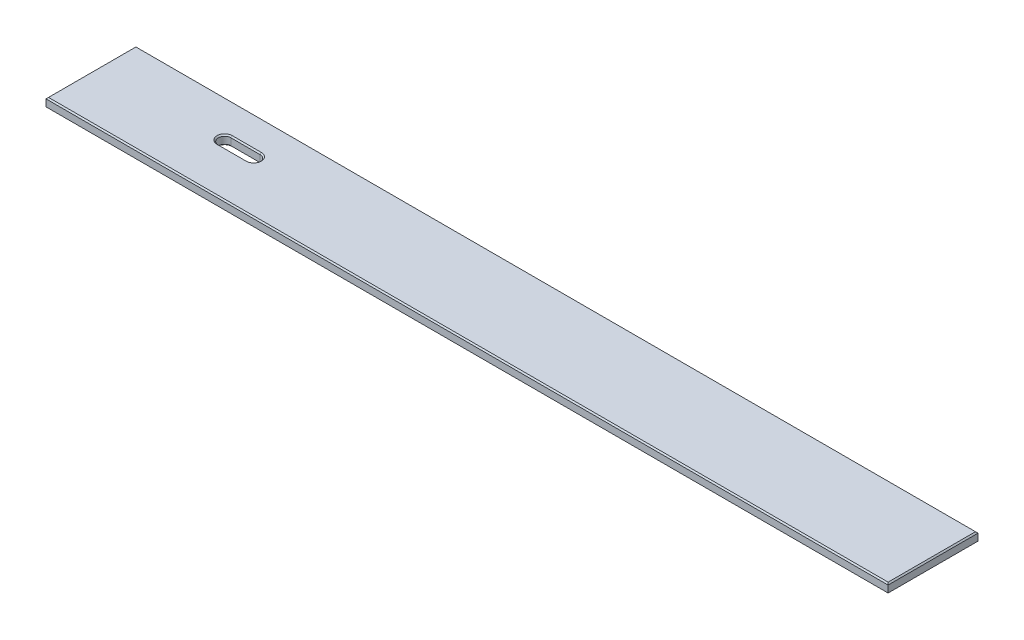
ISO-10303-21;
HEADER;
FILE_DESCRIPTION(('STEP AP214'),'2;1');
FILE_NAME('part.step','',(''),(''),'','','');
FILE_SCHEMA(('AUTOMOTIVE_DESIGN { 1 0 10303 214 1 1 1 1 }'));
ENDSEC;
DATA;
#1=APPLICATION_CONTEXT('core data for automotive mechanical design processes');
#2=APPLICATION_PROTOCOL_DEFINITION('international standard','automotive_design',2000,#1);
#3=PRODUCT_CONTEXT('',#1,'mechanical');
#4=PRODUCT('Part','Part','',(#3));
#5=PRODUCT_RELATED_PRODUCT_CATEGORY('part','',(#4));
#6=PRODUCT_DEFINITION_FORMATION('','',#4);
#7=PRODUCT_DEFINITION_CONTEXT('part definition',#1,'design');
#8=PRODUCT_DEFINITION('design','',#6,#7);
#9=PRODUCT_DEFINITION_SHAPE('','',#8);
#10=(LENGTH_UNIT() NAMED_UNIT(*) SI_UNIT(.MILLI.,.METRE.));
#11=(NAMED_UNIT(*) PLANE_ANGLE_UNIT() SI_UNIT($,.RADIAN.));
#12=(NAMED_UNIT(*) SI_UNIT($,.STERADIAN.) SOLID_ANGLE_UNIT());
#13=UNCERTAINTY_MEASURE_WITH_UNIT(LENGTH_MEASURE(1.E-05),#10,'distance_accuracy_value','');
#14=(GEOMETRIC_REPRESENTATION_CONTEXT(3) GLOBAL_UNCERTAINTY_ASSIGNED_CONTEXT((#13)) GLOBAL_UNIT_ASSIGNED_CONTEXT((#10,
#11,#12)) REPRESENTATION_CONTEXT('',''));
#15=CARTESIAN_POINT('',(0.,0.,0.));
#16=DIRECTION('',(0.,0.,1.));
#17=DIRECTION('',(1.,0.,0.));
#18=AXIS2_PLACEMENT_3D('',#15,#16,#17);
#19=CARTESIAN_POINT('',(0.,19.05,0.));
#20=DIRECTION('',(0.,-1.,0.));
#21=DIRECTION('',(0.,0.,-1.));
#22=AXIS2_PLACEMENT_3D('',#19,#20,#21);
#23=PLANE('',#22);
#24=CARTESIAN_POINT('',(254.,19.05,-105.55605));
#25=DIRECTION('',(0.,-1.,0.));
#26=DIRECTION('',(0.,0.,-1.));
#27=AXIS2_PLACEMENT_3D('',#24,#25,#26);
#28=CIRCLE('',#27,15.2400000000006);
#29=CARTESIAN_POINT('',(254.,19.05,-90.3160499999994));
#30=VERTEX_POINT('',#29);
#31=CARTESIAN_POINT('',(254.,19.05,-120.796050000001));
#32=VERTEX_POINT('',#31);
#33=EDGE_CURVE('E217',#30,#32,#28,.T.);
#34=ORIENTED_EDGE('',*,*,#33,.T.);
#35=DIRECTION('',(1.,0.,0.));
#36=VECTOR('',#35,1.);
#37=CARTESIAN_POINT('',(312.7502,19.05,-120.796050000001));
#38=LINE('',#37,#36);
#39=CARTESIAN_POINT('',(312.7502,19.05,-120.796050000001));
#40=VERTEX_POINT('',#39);
#41=EDGE_CURVE('E219',#32,#40,#38,.T.);
#42=ORIENTED_EDGE('',*,*,#41,.T.);
#43=CARTESIAN_POINT('',(312.7502,19.05,-105.55605));
#44=DIRECTION('',(0.,-1.,0.));
#45=DIRECTION('',(0.,0.,-1.));
#46=AXIS2_PLACEMENT_3D('',#43,#44,#45);
#47=CIRCLE('',#46,15.2400000000006);
#48=CARTESIAN_POINT('',(312.7502,19.05,-90.3160499999994));
#49=VERTEX_POINT('',#48);
#50=EDGE_CURVE('E188',#40,#49,#47,.T.);
#51=ORIENTED_EDGE('',*,*,#50,.T.);
#52=DIRECTION('',(-1.,0.,0.));
#53=VECTOR('',#52,1.);
#54=CARTESIAN_POINT('',(254.,19.05,-90.3160499999994));
#55=LINE('',#54,#53);
#56=EDGE_CURVE('E215',#49,#30,#55,.T.);
#57=ORIENTED_EDGE('',*,*,#56,.T.);
#58=EDGE_LOOP('',(#34,#42,#51,#57));
#59=FACE_BOUND('',#58,.T.);
#60=DIRECTION('',(0.,0.,-1.));
#61=VECTOR('',#60,1.);
#62=CARTESIAN_POINT('',(1692.91,19.05,0.));
#63=LINE('',#62,#61);
#64=CARTESIAN_POINT('',(1692.91,19.05,-2.53999999999999));
#65=VERTEX_POINT('',#64);
#66=CARTESIAN_POINT('',(1692.91,19.05,-178.435));
#67=VERTEX_POINT('',#66);
#68=EDGE_CURVE('E209',#65,#67,#63,.T.);
#69=ORIENTED_EDGE('',*,*,#68,.T.);
#70=DIRECTION('',(-1.,0.,0.));
#71=VECTOR('',#70,1.);
#72=CARTESIAN_POINT('',(0.,19.05,-178.435));
#73=LINE('',#72,#71);
#74=CARTESIAN_POINT('',(2.53999999999999,19.05,-178.435));
#75=VERTEX_POINT('',#74);
#76=EDGE_CURVE('E211',#67,#75,#73,.T.);
#77=ORIENTED_EDGE('',*,*,#76,.T.);
#78=DIRECTION('',(0.,0.,1.));
#79=VECTOR('',#78,1.);
#80=CARTESIAN_POINT('',(2.53999999999999,19.05,0.));
#81=LINE('',#80,#79);
#82=CARTESIAN_POINT('',(2.53999999999999,19.05,-2.53999999999999));
#83=VERTEX_POINT('',#82);
#84=EDGE_CURVE('E198',#75,#83,#81,.T.);
#85=ORIENTED_EDGE('',*,*,#84,.T.);
#86=DIRECTION('',(1.,0.,0.));
#87=VECTOR('',#86,1.);
#88=CARTESIAN_POINT('',(0.,19.05,-2.53999999999999));
#89=LINE('',#88,#87);
#90=EDGE_CURVE('E201',#83,#65,#89,.T.);
#91=ORIENTED_EDGE('',*,*,#90,.T.);
#92=EDGE_LOOP('',(#69,#77,#85,#91));
#93=FACE_BOUND('',#92,.T.);
#94=ADVANCED_FACE('F41',(#59,#93),#23,.F.);
#95=CARTESIAN_POINT('',(0.,0.,0.));
#96=DIRECTION('',(0.,-1.,0.));
#97=DIRECTION('',(0.,0.,-1.));
#98=AXIS2_PLACEMENT_3D('',#95,#96,#97);
#99=PLANE('',#98);
#100=DIRECTION('',(-1.,0.,0.));
#101=VECTOR('',#100,1.);
#102=CARTESIAN_POINT('',(0.,0.,-120.79605));
#103=LINE('',#102,#101);
#104=CARTESIAN_POINT('',(312.7502,0.,-120.79605));
#105=VERTEX_POINT('',#104);
#106=CARTESIAN_POINT('',(254.,0.,-120.79605));
#107=VERTEX_POINT('',#106);
#108=EDGE_CURVE('E261',#105,#107,#103,.T.);
#109=ORIENTED_EDGE('',*,*,#108,.T.);
#110=CARTESIAN_POINT('',(254.,0.,-105.55605));
#111=DIRECTION('',(0.,-1.,0.));
#112=DIRECTION('',(0.,0.,-1.));
#113=AXIS2_PLACEMENT_3D('',#110,#111,#112);
#114=CIRCLE('',#113,15.24);
#115=CARTESIAN_POINT('',(254.,0.,-90.31605));
#116=VERTEX_POINT('',#115);
#117=EDGE_CURVE('E263',#107,#116,#114,.F.);
#118=ORIENTED_EDGE('',*,*,#117,.T.);
#119=DIRECTION('',(1.,0.,0.));
#120=VECTOR('',#119,1.);
#121=CARTESIAN_POINT('',(0.,0.,-90.31605));
#122=LINE('',#121,#120);
#123=CARTESIAN_POINT('',(312.7502,0.,-90.31605));
#124=VERTEX_POINT('',#123);
#125=EDGE_CURVE('E257',#116,#124,#122,.T.);
#126=ORIENTED_EDGE('',*,*,#125,.T.);
#127=CARTESIAN_POINT('',(312.7502,0.,-105.55605));
#128=DIRECTION('',(0.,-1.,0.));
#129=DIRECTION('',(0.,0.,-1.));
#130=AXIS2_PLACEMENT_3D('',#127,#128,#129);
#131=CIRCLE('',#130,15.24);
#132=EDGE_CURVE('E259',#124,#105,#131,.F.);
#133=ORIENTED_EDGE('',*,*,#132,.T.);
#134=EDGE_LOOP('',(#109,#118,#126,#133));
#135=FACE_BOUND('',#134,.T.);
#136=DIRECTION('',(0.,0.,1.));
#137=VECTOR('',#136,1.);
#138=CARTESIAN_POINT('',(1692.91,0.,0.));
#139=LINE('',#138,#137);
#140=CARTESIAN_POINT('',(1692.91,0.,-178.435));
#141=VERTEX_POINT('',#140);
#142=CARTESIAN_POINT('',(1692.91,0.,-2.53999999999999));
#143=VERTEX_POINT('',#142);
#144=EDGE_CURVE('E252',#141,#143,#139,.T.);
#145=ORIENTED_EDGE('',*,*,#144,.T.);
#146=DIRECTION('',(-1.,0.,0.));
#147=VECTOR('',#146,1.);
#148=CARTESIAN_POINT('',(0.,0.,-2.53999999999999));
#149=LINE('',#148,#147);
#150=CARTESIAN_POINT('',(2.53999999999999,0.,-2.53999999999999));
#151=VERTEX_POINT('',#150);
#152=EDGE_CURVE('E254',#143,#151,#149,.T.);
#153=ORIENTED_EDGE('',*,*,#152,.T.);
#154=DIRECTION('',(0.,0.,-1.));
#155=VECTOR('',#154,1.);
#156=CARTESIAN_POINT('',(2.53999999999999,0.,-180.975));
#157=LINE('',#156,#155);
#158=CARTESIAN_POINT('',(2.53999999999999,0.,-178.435));
#159=VERTEX_POINT('',#158);
#160=EDGE_CURVE('E232',#151,#159,#157,.T.);
#161=ORIENTED_EDGE('',*,*,#160,.T.);
#162=DIRECTION('',(1.,0.,0.));
#163=VECTOR('',#162,1.);
#164=CARTESIAN_POINT('',(1695.45,0.,-178.435));
#165=LINE('',#164,#163);
#166=EDGE_CURVE('E250',#159,#141,#165,.T.);
#167=ORIENTED_EDGE('',*,*,#166,.T.);
#168=EDGE_LOOP('',(#145,#153,#161,#167));
#169=FACE_BOUND('',#168,.T.);
#170=ADVANCED_FACE('F306',(#135,#169),#99,.T.);
#171=CARTESIAN_POINT('',(0.,19.05,0.));
#172=DIRECTION('',(1.,0.,0.));
#173=DIRECTION('',(0.,0.,-1.));
#174=AXIS2_PLACEMENT_3D('',#171,#172,#173);
#175=PLANE('',#174);
#176=DIRECTION('',(0.,-1.,0.));
#177=VECTOR('',#176,1.);
#178=CARTESIAN_POINT('',(0.,19.05,-180.975));
#179=LINE('',#178,#177);
#180=CARTESIAN_POINT('',(0.,16.51,-180.975));
#181=VERTEX_POINT('',#180);
#182=CARTESIAN_POINT('',(0.,2.53999999999999,-180.975));
#183=VERTEX_POINT('',#182);
#184=EDGE_CURVE('E182',#181,#183,#179,.T.);
#185=ORIENTED_EDGE('',*,*,#184,.T.);
#186=DIRECTION('',(0.,0.,1.));
#187=VECTOR('',#186,1.);
#188=CARTESIAN_POINT('',(0.,2.53999999999999,0.));
#189=LINE('',#188,#187);
#190=CARTESIAN_POINT('',(0.,2.53999999999999,0.));
#191=VERTEX_POINT('',#190);
#192=EDGE_CURVE('E11',#183,#191,#189,.T.);
#193=ORIENTED_EDGE('',*,*,#192,.T.);
#194=DIRECTION('',(0.,-1.,0.));
#195=VECTOR('',#194,1.);
#196=CARTESIAN_POINT('',(0.,19.05,0.));
#197=LINE('',#196,#195);
#198=CARTESIAN_POINT('',(0.,16.51,0.));
#199=VERTEX_POINT('',#198);
#200=EDGE_CURVE('E199',#199,#191,#197,.T.);
#201=ORIENTED_EDGE('',*,*,#200,.F.);
#202=DIRECTION('',(0.,0.,-1.));
#203=VECTOR('',#202,1.);
#204=CARTESIAN_POINT('',(0.,16.51,0.));
#205=LINE('',#204,#203);
#206=EDGE_CURVE('E230',#199,#181,#205,.T.);
#207=ORIENTED_EDGE('',*,*,#206,.T.);
#208=EDGE_LOOP('',(#185,#193,#201,#207));
#209=FACE_BOUND('',#208,.T.);
#210=ADVANCED_FACE('F379',(#209),#175,.F.);
#211=CARTESIAN_POINT('',(0.,19.05,0.));
#212=DIRECTION('',(0.,0.,-1.));
#213=DIRECTION('',(-1.,0.,0.));
#214=AXIS2_PLACEMENT_3D('',#211,#212,#213);
#215=PLANE('',#214);
#216=ORIENTED_EDGE('',*,*,#200,.T.);
#217=DIRECTION('',(1.,0.,0.));
#218=VECTOR('',#217,1.);
#219=CARTESIAN_POINT('',(1695.45,2.53999999999999,0.));
#220=LINE('',#219,#218);
#221=CARTESIAN_POINT('',(1695.45,2.53999999999999,0.));
#222=VERTEX_POINT('',#221);
#223=EDGE_CURVE('E274',#191,#222,#220,.T.);
#224=ORIENTED_EDGE('',*,*,#223,.T.);
#225=DIRECTION('',(0.,-1.,0.));
#226=VECTOR('',#225,1.);
#227=CARTESIAN_POINT('',(1695.45,19.05,0.));
#228=LINE('',#227,#226);
#229=CARTESIAN_POINT('',(1695.45,16.51,0.));
#230=VERTEX_POINT('',#229);
#231=EDGE_CURVE('E204',#230,#222,#228,.T.);
#232=ORIENTED_EDGE('',*,*,#231,.F.);
#233=DIRECTION('',(-1.,0.,0.));
#234=VECTOR('',#233,1.);
#235=CARTESIAN_POINT('',(0.,16.51,0.));
#236=LINE('',#235,#234);
#237=EDGE_CURVE('E228',#230,#199,#236,.T.);
#238=ORIENTED_EDGE('',*,*,#237,.T.);
#239=EDGE_LOOP('',(#216,#224,#232,#238));
#240=FACE_BOUND('',#239,.T.);
#241=ADVANCED_FACE('F315',(#240),#215,.F.);
#242=CARTESIAN_POINT('',(1695.45,19.05,0.));
#243=DIRECTION('',(-1.,0.,0.));
#244=DIRECTION('',(0.,0.,1.));
#245=AXIS2_PLACEMENT_3D('',#242,#243,#244);
#246=PLANE('',#245);
#247=ORIENTED_EDGE('',*,*,#231,.T.);
#248=DIRECTION('',(0.,0.,-1.));
#249=VECTOR('',#248,1.);
#250=CARTESIAN_POINT('',(1695.45,2.53999999999999,-180.975));
#251=LINE('',#250,#249);
#252=CARTESIAN_POINT('',(1695.45,2.53999999999999,-180.975));
#253=VERTEX_POINT('',#252);
#254=EDGE_CURVE('E66',#222,#253,#251,.T.);
#255=ORIENTED_EDGE('',*,*,#254,.T.);
#256=DIRECTION('',(0.,-1.,0.));
#257=VECTOR('',#256,1.);
#258=CARTESIAN_POINT('',(1695.45,19.05,-180.975));
#259=LINE('',#258,#257);
#260=CARTESIAN_POINT('',(1695.45,16.51,-180.975));
#261=VERTEX_POINT('',#260);
#262=EDGE_CURVE('E320',#261,#253,#259,.T.);
#263=ORIENTED_EDGE('',*,*,#262,.F.);
#264=DIRECTION('',(0.,0.,1.));
#265=VECTOR('',#264,1.);
#266=CARTESIAN_POINT('',(1695.45,16.51,0.));
#267=LINE('',#266,#265);
#268=EDGE_CURVE('E226',#261,#230,#267,.T.);
#269=ORIENTED_EDGE('',*,*,#268,.T.);
#270=EDGE_LOOP('',(#247,#255,#263,#269));
#271=FACE_BOUND('',#270,.T.);
#272=ADVANCED_FACE('F318',(#271),#246,.F.);
#273=CARTESIAN_POINT('',(0.,19.05,-180.975));
#274=DIRECTION('',(0.,0.,1.));
#275=DIRECTION('',(1.,0.,0.));
#276=AXIS2_PLACEMENT_3D('',#273,#274,#275);
#277=PLANE('',#276);
#278=ORIENTED_EDGE('',*,*,#262,.T.);
#279=DIRECTION('',(-1.,0.,0.));
#280=VECTOR('',#279,1.);
#281=CARTESIAN_POINT('',(0.,2.53999999999999,-180.975));
#282=LINE('',#281,#280);
#283=EDGE_CURVE('E51',#253,#183,#282,.T.);
#284=ORIENTED_EDGE('',*,*,#283,.T.);
#285=ORIENTED_EDGE('',*,*,#184,.F.);
#286=DIRECTION('',(1.,0.,0.));
#287=VECTOR('',#286,1.);
#288=CARTESIAN_POINT('',(0.,16.51,-180.975));
#289=LINE('',#288,#287);
#290=EDGE_CURVE('E170',#181,#261,#289,.T.);
#291=ORIENTED_EDGE('',*,*,#290,.T.);
#292=EDGE_LOOP('',(#278,#284,#285,#291));
#293=FACE_BOUND('',#292,.T.);
#294=ADVANCED_FACE('F380',(#293),#277,.F.);
#295=CARTESIAN_POINT('',(312.7502,19.05,-105.55605));
#296=DIRECTION('',(0.,-1.,0.));
#297=DIRECTION('',(0.,0.,-1.));
#298=AXIS2_PLACEMENT_3D('',#295,#296,#297);
#299=CYLINDRICAL_SURFACE('',#298,12.7);
#300=DIRECTION('',(0.,-1.,0.));
#301=VECTOR('',#300,1.);
#302=CARTESIAN_POINT('',(312.7502,19.05,-118.25605));
#303=LINE('',#302,#301);
#304=CARTESIAN_POINT('',(312.7502,16.5099999999991,-118.25605));
#305=VERTEX_POINT('',#304);
#306=CARTESIAN_POINT('',(312.7502,2.53999999999999,-118.25605));
#307=VERTEX_POINT('',#306);
#308=EDGE_CURVE('E162',#305,#307,#303,.T.);
#309=ORIENTED_EDGE('',*,*,#308,.T.);
#310=CARTESIAN_POINT('',(312.7502,2.53999999999999,-105.55605));
#311=DIRECTION('',(0.,-1.,0.));
#312=DIRECTION('',(0.,0.,-1.));
#313=AXIS2_PLACEMENT_3D('',#310,#311,#312);
#314=CIRCLE('',#313,12.7);
#315=CARTESIAN_POINT('',(312.7502,2.53999999999999,-92.85605));
#316=VERTEX_POINT('',#315);
#317=EDGE_CURVE('E270',#307,#316,#314,.T.);
#318=ORIENTED_EDGE('',*,*,#317,.T.);
#319=DIRECTION('',(0.,-1.,0.));
#320=VECTOR('',#319,1.);
#321=CARTESIAN_POINT('',(312.7502,19.05,-92.85605));
#322=LINE('',#321,#320);
#323=CARTESIAN_POINT('',(312.7502,16.5099999999991,-92.85605));
#324=VERTEX_POINT('',#323);
#325=EDGE_CURVE('E165',#324,#316,#322,.T.);
#326=ORIENTED_EDGE('',*,*,#325,.F.);
#327=CARTESIAN_POINT('',(312.7502,16.5099999999991,-105.55605));
#328=DIRECTION('',(0.,-1.,0.));
#329=DIRECTION('',(0.,0.,-1.));
#330=AXIS2_PLACEMENT_3D('',#327,#328,#329);
#331=CIRCLE('',#330,12.7);
#332=EDGE_CURVE('E159',#324,#305,#331,.F.);
#333=ORIENTED_EDGE('',*,*,#332,.T.);
#334=EDGE_LOOP('',(#309,#318,#326,#333));
#335=FACE_BOUND('',#334,.T.);
#336=ADVANCED_FACE('F161',(#335),#299,.F.);
#337=CARTESIAN_POINT('',(254.,19.05,-118.25605));
#338=DIRECTION('',(0.,0.,1.));
#339=DIRECTION('',(1.,0.,0.));
#340=AXIS2_PLACEMENT_3D('',#337,#338,#339);
#341=PLANE('',#340);
#342=DIRECTION('',(0.,-1.,0.));
#343=VECTOR('',#342,1.);
#344=CARTESIAN_POINT('',(254.,19.05,-118.25605));
#345=LINE('',#344,#343);
#346=CARTESIAN_POINT('',(254.,16.5099999999991,-118.25605));
#347=VERTEX_POINT('',#346);
#348=CARTESIAN_POINT('',(254.,2.53999999999999,-118.25605));
#349=VERTEX_POINT('',#348);
#350=EDGE_CURVE('E183',#347,#349,#345,.T.);
#351=ORIENTED_EDGE('',*,*,#350,.T.);
#352=DIRECTION('',(1.,0.,0.));
#353=VECTOR('',#352,1.);
#354=CARTESIAN_POINT('',(254.,2.53999999999999,-118.25605));
#355=LINE('',#354,#353);
#356=EDGE_CURVE('E181',#349,#307,#355,.T.);
#357=ORIENTED_EDGE('',*,*,#356,.T.);
#358=ORIENTED_EDGE('',*,*,#308,.F.);
#359=DIRECTION('',(-1.,0.,0.));
#360=VECTOR('',#359,1.);
#361=CARTESIAN_POINT('',(254.,16.5099999999991,-118.25605));
#362=LINE('',#361,#360);
#363=EDGE_CURVE('E178',#305,#347,#362,.T.);
#364=ORIENTED_EDGE('',*,*,#363,.T.);
#365=EDGE_LOOP('',(#351,#357,#358,#364));
#366=FACE_BOUND('',#365,.T.);
#367=ADVANCED_FACE('F176',(#366),#341,.T.);
#368=CARTESIAN_POINT('',(254.,19.05,-105.55605));
#369=DIRECTION('',(0.,-1.,0.));
#370=DIRECTION('',(0.,0.,-1.));
#371=AXIS2_PLACEMENT_3D('',#368,#369,#370);
#372=CYLINDRICAL_SURFACE('',#371,12.7);
#373=DIRECTION('',(0.,-1.,0.));
#374=VECTOR('',#373,1.);
#375=CARTESIAN_POINT('',(254.,19.05,-92.85605));
#376=LINE('',#375,#374);
#377=CARTESIAN_POINT('',(254.,16.5099999999991,-92.85605));
#378=VERTEX_POINT('',#377);
#379=CARTESIAN_POINT('',(254.,2.53999999999999,-92.85605));
#380=VERTEX_POINT('',#379);
#381=EDGE_CURVE('E325',#378,#380,#376,.T.);
#382=ORIENTED_EDGE('',*,*,#381,.T.);
#383=CARTESIAN_POINT('',(254.,2.53999999999999,-105.55605));
#384=DIRECTION('',(0.,-1.,0.));
#385=DIRECTION('',(0.,0.,-1.));
#386=AXIS2_PLACEMENT_3D('',#383,#384,#385);
#387=CIRCLE('',#386,12.7);
#388=EDGE_CURVE('E266',#380,#349,#387,.T.);
#389=ORIENTED_EDGE('',*,*,#388,.T.);
#390=ORIENTED_EDGE('',*,*,#350,.F.);
#391=CARTESIAN_POINT('',(254.,16.5099999999991,-105.55605));
#392=DIRECTION('',(0.,-1.,0.));
#393=DIRECTION('',(0.,0.,-1.));
#394=AXIS2_PLACEMENT_3D('',#391,#392,#393);
#395=CIRCLE('',#394,12.7);
#396=EDGE_CURVE('E221',#347,#378,#395,.F.);
#397=ORIENTED_EDGE('',*,*,#396,.T.);
#398=EDGE_LOOP('',(#382,#389,#390,#397));
#399=FACE_BOUND('',#398,.T.);
#400=ADVANCED_FACE('F348',(#399),#372,.F.);
#401=CARTESIAN_POINT('',(254.,19.05,-92.85605));
#402=DIRECTION('',(0.,0.,-1.));
#403=DIRECTION('',(-1.,0.,0.));
#404=AXIS2_PLACEMENT_3D('',#401,#402,#403);
#405=PLANE('',#404);
#406=ORIENTED_EDGE('',*,*,#325,.T.);
#407=DIRECTION('',(-1.,0.,0.));
#408=VECTOR('',#407,1.);
#409=CARTESIAN_POINT('',(254.,2.53999999999999,-92.85605));
#410=LINE('',#409,#408);
#411=EDGE_CURVE('E272',#316,#380,#410,.T.);
#412=ORIENTED_EDGE('',*,*,#411,.T.);
#413=ORIENTED_EDGE('',*,*,#381,.F.);
#414=DIRECTION('',(1.,0.,0.));
#415=VECTOR('',#414,1.);
#416=CARTESIAN_POINT('',(312.7502,16.5099999999991,-92.85605));
#417=LINE('',#416,#415);
#418=EDGE_CURVE('E171',#378,#324,#417,.T.);
#419=ORIENTED_EDGE('',*,*,#418,.T.);
#420=EDGE_LOOP('',(#406,#412,#413,#419));
#421=FACE_BOUND('',#420,.T.);
#422=ADVANCED_FACE('F330',(#421),#405,.T.);
#423=CARTESIAN_POINT('',(254.,16.5099999999991,-92.85605));
#424=DIRECTION('',(0.,0.707106781186511,-0.707106781186584));
#425=DIRECTION('',(-1.,0.,0.));
#426=AXIS2_PLACEMENT_3D('',#423,#424,#425);
#427=PLANE('',#426);
#428=DIRECTION('',(0.,-0.707106781186585,-0.70710678118651));
#429=VECTOR('',#428,1.);
#430=CARTESIAN_POINT('',(254.,19.05,-90.3160499999994));
#431=LINE('',#430,#429);
#432=EDGE_CURVE('E192',#30,#378,#431,.T.);
#433=ORIENTED_EDGE('',*,*,#432,.F.);
#434=ORIENTED_EDGE('',*,*,#56,.F.);
#435=DIRECTION('',(0.,0.707106781186585,0.70710678118651));
#436=VECTOR('',#435,1.);
#437=CARTESIAN_POINT('',(312.7502,16.5099999999991,-92.85605));
#438=LINE('',#437,#436);
#439=EDGE_CURVE('E237',#324,#49,#438,.T.);
#440=ORIENTED_EDGE('',*,*,#439,.F.);
#441=ORIENTED_EDGE('',*,*,#418,.F.);
#442=EDGE_LOOP('',(#433,#434,#440,#441));
#443=FACE_BOUND('',#442,.T.);
#444=ADVANCED_FACE('F351',(#443),#427,.T.);
#445=CARTESIAN_POINT('',(312.7502,16.5099999999991,-105.55605));
#446=DIRECTION('',(0.,1.,0.));
#447=DIRECTION('',(0.,0.,1.));
#448=AXIS2_PLACEMENT_3D('',#445,#446,#447);
#449=CONICAL_SURFACE('',#448,12.7,0.785398163397396);
#450=ORIENTED_EDGE('',*,*,#439,.T.);
#451=ORIENTED_EDGE('',*,*,#50,.F.);
#452=DIRECTION('',(0.,0.707106781186585,-0.70710678118651));
#453=VECTOR('',#452,1.);
#454=CARTESIAN_POINT('',(312.7502,16.5099999999991,-118.25605));
#455=LINE('',#454,#453);
#456=EDGE_CURVE('E186',#305,#40,#455,.T.);
#457=ORIENTED_EDGE('',*,*,#456,.F.);
#458=ORIENTED_EDGE('',*,*,#332,.F.);
#459=EDGE_LOOP('',(#450,#451,#457,#458));
#460=FACE_BOUND('',#459,.T.);
#461=ADVANCED_FACE('F187',(#460),#449,.F.);
#462=CARTESIAN_POINT('',(254.,16.5099999999991,-105.55605));
#463=DIRECTION('',(0.,1.,0.));
#464=DIRECTION('',(0.,0.,1.));
#465=AXIS2_PLACEMENT_3D('',#462,#463,#464);
#466=CONICAL_SURFACE('',#465,12.7,0.785398163397396);
#467=ORIENTED_EDGE('',*,*,#432,.T.);
#468=ORIENTED_EDGE('',*,*,#396,.F.);
#469=DIRECTION('',(0.,-0.707106781186585,0.70710678118651));
#470=VECTOR('',#469,1.);
#471=CARTESIAN_POINT('',(254.,19.05,-120.796050000001));
#472=LINE('',#471,#470);
#473=EDGE_CURVE('E193',#32,#347,#472,.T.);
#474=ORIENTED_EDGE('',*,*,#473,.F.);
#475=ORIENTED_EDGE('',*,*,#33,.F.);
#476=EDGE_LOOP('',(#467,#468,#474,#475));
#477=FACE_BOUND('',#476,.T.);
#478=ADVANCED_FACE('F355',(#477),#466,.F.);
#479=CARTESIAN_POINT('',(254.,16.5099999999991,-118.25605));
#480=DIRECTION('',(0.,0.70710678118651,0.707106781186585));
#481=DIRECTION('',(1.,0.,0.));
#482=AXIS2_PLACEMENT_3D('',#479,#480,#481);
#483=PLANE('',#482);
#484=ORIENTED_EDGE('',*,*,#456,.T.);
#485=ORIENTED_EDGE('',*,*,#41,.F.);
#486=ORIENTED_EDGE('',*,*,#473,.T.);
#487=ORIENTED_EDGE('',*,*,#363,.F.);
#488=EDGE_LOOP('',(#484,#485,#486,#487));
#489=FACE_BOUND('',#488,.T.);
#490=ADVANCED_FACE('F195',(#489),#483,.T.);
#491=CARTESIAN_POINT('',(0.,19.05,-2.53999999999999));
#492=DIRECTION('',(0.,-0.707106781186547,-0.707106781186548));
#493=DIRECTION('',(1.,0.,0.));
#494=AXIS2_PLACEMENT_3D('',#491,#492,#493);
#495=PLANE('',#494);
#496=DIRECTION('',(0.577350269189626,0.577350269189626,-0.577350269189626));
#497=VECTOR('',#496,1.);
#498=CARTESIAN_POINT('',(1.69333333333332,18.2033333333333,-1.69333333333332));
#499=LINE('',#498,#497);
#500=EDGE_CURVE('E244',#199,#83,#499,.T.);
#501=ORIENTED_EDGE('',*,*,#500,.F.);
#502=ORIENTED_EDGE('',*,*,#237,.F.);
#503=DIRECTION('',(-0.577350269189626,0.577350269189626,-0.577350269189626));
#504=VECTOR('',#503,1.);
#505=CARTESIAN_POINT('',(1128.60666666667,583.353333333334,-566.843333333333));
#506=LINE('',#505,#504);
#507=EDGE_CURVE('E233',#65,#230,#506,.F.);
#508=ORIENTED_EDGE('',*,*,#507,.F.);
#509=ORIENTED_EDGE('',*,*,#90,.F.);
#510=EDGE_LOOP('',(#501,#502,#508,#509));
#511=FACE_BOUND('',#510,.T.);
#512=ADVANCED_FACE('F377',(#511),#495,.F.);
#513=CARTESIAN_POINT('',(1692.91,19.05,0.));
#514=DIRECTION('',(-0.707106781186548,-0.707106781186548,0.));
#515=DIRECTION('',(0.,0.,-1.));
#516=AXIS2_PLACEMENT_3D('',#513,#514,#515);
#517=PLANE('',#516);
#518=ORIENTED_EDGE('',*,*,#507,.T.);
#519=ORIENTED_EDGE('',*,*,#268,.F.);
#520=DIRECTION('',(-0.577350269189626,0.577350269189626,0.577350269189626));
#521=VECTOR('',#520,1.);
#522=CARTESIAN_POINT('',(1633.43166666667,78.5283333333333,-118.956666666667));
#523=LINE('',#522,#521);
#524=EDGE_CURVE('E241',#67,#261,#523,.F.);
#525=ORIENTED_EDGE('',*,*,#524,.F.);
#526=ORIENTED_EDGE('',*,*,#68,.F.);
#527=EDGE_LOOP('',(#518,#519,#525,#526));
#528=FACE_BOUND('',#527,.T.);
#529=ADVANCED_FACE('F366',(#528),#517,.F.);
#530=CARTESIAN_POINT('',(2.53999999999999,19.05,0.));
#531=DIRECTION('',(0.707106781186548,-0.707106781186547,0.));
#532=DIRECTION('',(0.,0.,1.));
#533=AXIS2_PLACEMENT_3D('',#530,#531,#532);
#534=PLANE('',#533);
#535=ORIENTED_EDGE('',*,*,#500,.T.);
#536=ORIENTED_EDGE('',*,*,#84,.F.);
#537=DIRECTION('',(-0.577350269189626,-0.577350269189626,-0.577350269189626));
#538=VECTOR('',#537,1.);
#539=CARTESIAN_POINT('',(62.0183333333333,78.5283333333334,-118.956666666667));
#540=LINE('',#539,#538);
#541=EDGE_CURVE('E239',#181,#75,#540,.F.);
#542=ORIENTED_EDGE('',*,*,#541,.F.);
#543=ORIENTED_EDGE('',*,*,#206,.F.);
#544=EDGE_LOOP('',(#535,#536,#542,#543));
#545=FACE_BOUND('',#544,.T.);
#546=ADVANCED_FACE('F374',(#545),#534,.F.);
#547=CARTESIAN_POINT('',(0.,19.05,-178.435));
#548=DIRECTION('',(0.,-0.707106781186548,0.707106781186548));
#549=DIRECTION('',(-1.,0.,0.));
#550=AXIS2_PLACEMENT_3D('',#547,#548,#549);
#551=PLANE('',#550);
#552=ORIENTED_EDGE('',*,*,#524,.T.);
#553=ORIENTED_EDGE('',*,*,#290,.F.);
#554=ORIENTED_EDGE('',*,*,#541,.T.);
#555=ORIENTED_EDGE('',*,*,#76,.F.);
#556=EDGE_LOOP('',(#552,#553,#554,#555));
#557=FACE_BOUND('',#556,.T.);
#558=ADVANCED_FACE('F369',(#557),#551,.F.);
#559=CARTESIAN_POINT('',(312.7502,0.,-105.55605));
#560=DIRECTION('',(0.,-1.,0.));
#561=DIRECTION('',(0.,0.,-1.));
#562=AXIS2_PLACEMENT_3D('',#559,#560,#561);
#563=CONICAL_SURFACE('',#562,15.24,0.785398163397448);
#564=DIRECTION('',(0.,-0.707106781186548,0.707106781186548));
#565=VECTOR('',#564,1.);
#566=CARTESIAN_POINT('',(312.7502,2.53999999999999,-92.85605));
#567=LINE('',#566,#565);
#568=EDGE_CURVE('E283',#316,#124,#567,.T.);
#569=ORIENTED_EDGE('',*,*,#568,.F.);
#570=ORIENTED_EDGE('',*,*,#317,.F.);
#571=DIRECTION('',(0.,0.707106781186548,0.707106781186548));
#572=VECTOR('',#571,1.);
#573=CARTESIAN_POINT('',(312.7502,0.,-120.79605));
#574=LINE('',#573,#572);
#575=EDGE_CURVE('E242',#105,#307,#574,.T.);
#576=ORIENTED_EDGE('',*,*,#575,.F.);
#577=ORIENTED_EDGE('',*,*,#132,.F.);
#578=EDGE_LOOP('',(#569,#570,#576,#577));
#579=FACE_BOUND('',#578,.T.);
#580=ADVANCED_FACE('F336',(#579),#563,.F.);
#581=CARTESIAN_POINT('',(0.,0.,-120.79605));
#582=DIRECTION('',(0.,0.707106781186547,-0.707106781186548));
#583=DIRECTION('',(-1.,0.,0.));
#584=AXIS2_PLACEMENT_3D('',#581,#582,#583);
#585=PLANE('',#584);
#586=ORIENTED_EDGE('',*,*,#575,.T.);
#587=ORIENTED_EDGE('',*,*,#356,.F.);
#588=DIRECTION('',(0.,0.707106781186548,0.707106781186548));
#589=VECTOR('',#588,1.);
#590=CARTESIAN_POINT('',(254.,0.,-120.79605));
#591=LINE('',#590,#589);
#592=EDGE_CURVE('E281',#107,#349,#591,.T.);
#593=ORIENTED_EDGE('',*,*,#592,.F.);
#594=ORIENTED_EDGE('',*,*,#108,.F.);
#595=EDGE_LOOP('',(#586,#587,#593,#594));
#596=FACE_BOUND('',#595,.T.);
#597=ADVANCED_FACE('F447',(#596),#585,.F.);
#598=CARTESIAN_POINT('',(0.,0.,-90.31605));
#599=DIRECTION('',(0.,0.707106781186548,0.707106781186547));
#600=DIRECTION('',(1.,0.,0.));
#601=AXIS2_PLACEMENT_3D('',#598,#599,#600);
#602=PLANE('',#601);
#603=ORIENTED_EDGE('',*,*,#568,.T.);
#604=ORIENTED_EDGE('',*,*,#125,.F.);
#605=DIRECTION('',(0.,-0.707106781186548,0.707106781186548));
#606=VECTOR('',#605,1.);
#607=CARTESIAN_POINT('',(254.,2.53999999999999,-92.85605));
#608=LINE('',#607,#606);
#609=EDGE_CURVE('E279',#380,#116,#608,.T.);
#610=ORIENTED_EDGE('',*,*,#609,.F.);
#611=ORIENTED_EDGE('',*,*,#411,.F.);
#612=EDGE_LOOP('',(#603,#604,#610,#611));
#613=FACE_BOUND('',#612,.T.);
#614=ADVANCED_FACE('F341',(#613),#602,.F.);
#615=CARTESIAN_POINT('',(254.,0.,-105.55605));
#616=DIRECTION('',(0.,-1.,0.));
#617=DIRECTION('',(0.,0.,-1.));
#618=AXIS2_PLACEMENT_3D('',#615,#616,#617);
#619=CONICAL_SURFACE('',#618,15.24,0.785398163397448);
#620=ORIENTED_EDGE('',*,*,#592,.T.);
#621=ORIENTED_EDGE('',*,*,#388,.F.);
#622=ORIENTED_EDGE('',*,*,#609,.T.);
#623=ORIENTED_EDGE('',*,*,#117,.F.);
#624=EDGE_LOOP('',(#620,#621,#622,#623));
#625=FACE_BOUND('',#624,.T.);
#626=ADVANCED_FACE('F345',(#625),#619,.F.);
#627=CARTESIAN_POINT('',(0.,2.53999999999999,-180.975));
#628=DIRECTION('',(0.,-0.707106781186548,-0.707106781186548));
#629=DIRECTION('',(1.,0.,0.));
#630=AXIS2_PLACEMENT_3D('',#627,#628,#629);
#631=PLANE('',#630);
#632=DIRECTION('',(-0.577350269189626,-0.577350269189626,0.577350269189626));
#633=VECTOR('',#632,1.);
#634=CARTESIAN_POINT('',(1130.3,-562.61,384.175));
#635=LINE('',#634,#633);
#636=EDGE_CURVE('E291',#141,#253,#635,.F.);
#637=ORIENTED_EDGE('',*,*,#636,.F.);
#638=ORIENTED_EDGE('',*,*,#166,.F.);
#639=DIRECTION('',(0.577350269189626,-0.577350269189626,0.577350269189626));
#640=VECTOR('',#639,1.);
#641=CARTESIAN_POINT('',(60.325,-57.785,-120.65));
#642=LINE('',#641,#640);
#643=EDGE_CURVE('E46',#183,#159,#642,.T.);
#644=ORIENTED_EDGE('',*,*,#643,.F.);
#645=ORIENTED_EDGE('',*,*,#283,.F.);
#646=EDGE_LOOP('',(#637,#638,#644,#645));
#647=FACE_BOUND('',#646,.T.);
#648=ADVANCED_FACE('F44',(#647),#631,.T.);
#649=CARTESIAN_POINT('',(0.,2.53999999999999,0.));
#650=DIRECTION('',(-0.707106781186548,-0.707106781186547,0.));
#651=DIRECTION('',(0.,0.,-1.));
#652=AXIS2_PLACEMENT_3D('',#649,#650,#651);
#653=PLANE('',#652);
#654=ORIENTED_EDGE('',*,*,#643,.T.);
#655=ORIENTED_EDGE('',*,*,#160,.F.);
#656=DIRECTION('',(-0.577350269189626,0.577350269189626,0.577350269189626));
#657=VECTOR('',#656,1.);
#658=CARTESIAN_POINT('',(0.,2.53999999999999,0.));
#659=LINE('',#658,#657);
#660=EDGE_CURVE('E290',#191,#151,#659,.F.);
#661=ORIENTED_EDGE('',*,*,#660,.F.);
#662=ORIENTED_EDGE('',*,*,#192,.F.);
#663=EDGE_LOOP('',(#654,#655,#661,#662));
#664=FACE_BOUND('',#663,.T.);
#665=ADVANCED_FACE('F301',(#664),#653,.T.);
#666=CARTESIAN_POINT('',(1695.45,2.53999999999999,0.));
#667=DIRECTION('',(0.707106781186548,-0.707106781186548,0.));
#668=DIRECTION('',(0.,0.,1.));
#669=AXIS2_PLACEMENT_3D('',#666,#667,#668);
#670=PLANE('',#669);
#671=ORIENTED_EDGE('',*,*,#636,.T.);
#672=ORIENTED_EDGE('',*,*,#254,.F.);
#673=DIRECTION('',(-0.577350269189626,-0.577350269189626,-0.577350269189626));
#674=VECTOR('',#673,1.);
#675=CARTESIAN_POINT('',(1695.45,2.53999999999999,0.));
#676=LINE('',#675,#674);
#677=EDGE_CURVE('E288',#143,#222,#676,.F.);
#678=ORIENTED_EDGE('',*,*,#677,.F.);
#679=ORIENTED_EDGE('',*,*,#144,.F.);
#680=EDGE_LOOP('',(#671,#672,#678,#679));
#681=FACE_BOUND('',#680,.T.);
#682=ADVANCED_FACE('F312',(#681),#670,.T.);
#683=CARTESIAN_POINT('',(0.,2.53999999999999,0.));
#684=DIRECTION('',(0.,-0.707106781186547,0.707106781186548));
#685=DIRECTION('',(-1.,0.,0.));
#686=AXIS2_PLACEMENT_3D('',#683,#684,#685);
#687=PLANE('',#686);
#688=ORIENTED_EDGE('',*,*,#660,.T.);
#689=ORIENTED_EDGE('',*,*,#152,.F.);
#690=ORIENTED_EDGE('',*,*,#677,.T.);
#691=ORIENTED_EDGE('',*,*,#223,.F.);
#692=EDGE_LOOP('',(#688,#689,#690,#691));
#693=FACE_BOUND('',#692,.T.);
#694=ADVANCED_FACE('F310',(#693),#687,.T.);
#695=CLOSED_SHELL('',(#94,#170,#210,#241,#272,#294,#336,#367,#400,#422,#444,#461,#478,#490,#512,
#529,#546,#558,#580,#597,#614,#626,#648,#665,#682,#694));
#696=MANIFOLD_SOLID_BREP('B2',#695);
#697=ADVANCED_BREP_SHAPE_REPRESENTATION('',(#18,#696),#14);
#698=SHAPE_DEFINITION_REPRESENTATION(#9,#697);
ENDSEC;
END-ISO-10303-21;
